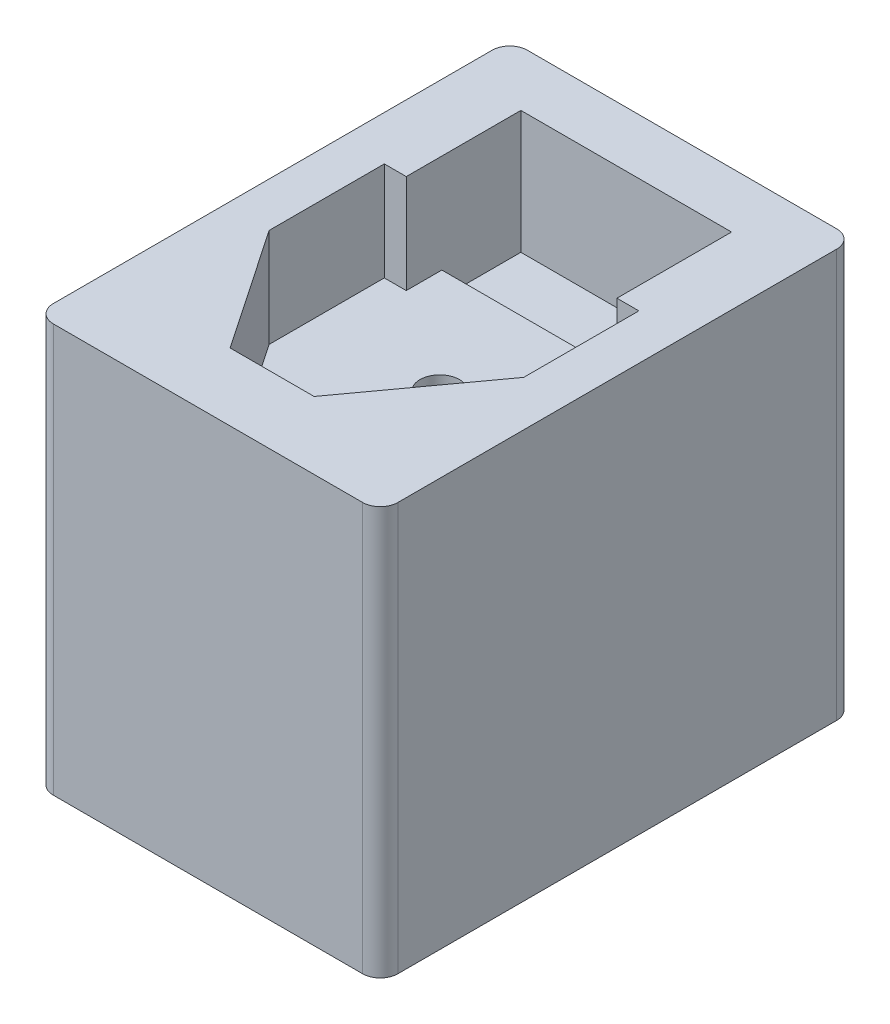
ISO-10303-21;
HEADER;
FILE_DESCRIPTION(('STEP AP214'),'2;1');
FILE_NAME('part.step','',(''),(''),'','','');
FILE_SCHEMA(('AUTOMOTIVE_DESIGN { 1 0 10303 214 1 1 1 1 }'));
ENDSEC;
DATA;
#1=APPLICATION_CONTEXT('core data for automotive mechanical design processes');
#2=APPLICATION_PROTOCOL_DEFINITION('international standard','automotive_design',2000,#1);
#3=PRODUCT_CONTEXT('',#1,'mechanical');
#4=PRODUCT('Part','Part','',(#3));
#5=PRODUCT_RELATED_PRODUCT_CATEGORY('part','',(#4));
#6=PRODUCT_DEFINITION_FORMATION('','',#4);
#7=PRODUCT_DEFINITION_CONTEXT('part definition',#1,'design');
#8=PRODUCT_DEFINITION('design','',#6,#7);
#9=PRODUCT_DEFINITION_SHAPE('','',#8);
#10=(LENGTH_UNIT() NAMED_UNIT(*) SI_UNIT(.MILLI.,.METRE.));
#11=(NAMED_UNIT(*) PLANE_ANGLE_UNIT() SI_UNIT($,.RADIAN.));
#12=(NAMED_UNIT(*) SI_UNIT($,.STERADIAN.) SOLID_ANGLE_UNIT());
#13=UNCERTAINTY_MEASURE_WITH_UNIT(LENGTH_MEASURE(1.E-05),#10,'distance_accuracy_value','');
#14=(GEOMETRIC_REPRESENTATION_CONTEXT(3) GLOBAL_UNCERTAINTY_ASSIGNED_CONTEXT((#13)) GLOBAL_UNIT_ASSIGNED_CONTEXT((#10,
#11,#12)) REPRESENTATION_CONTEXT('',''));
#15=CARTESIAN_POINT('',(0.,0.,0.));
#16=DIRECTION('',(0.,0.,1.));
#17=DIRECTION('',(1.,0.,0.));
#18=AXIS2_PLACEMENT_3D('',#15,#16,#17);
#19=CARTESIAN_POINT('',(-71.781203812325,31.8122496323421,5.04405962157267));
#20=DIRECTION('',(0.,1.,0.));
#21=DIRECTION('',(0.,0.,1.));
#22=AXIS2_PLACEMENT_3D('',#19,#20,#21);
#23=CYLINDRICAL_SURFACE('',#22,2.25);
#24=CARTESIAN_POINT('',(-71.781203812325,31.8122496323421,5.04405962157267));
#25=DIRECTION('',(0.,-1.,0.));
#26=DIRECTION('',(0.,0.,-1.));
#27=AXIS2_PLACEMENT_3D('',#24,#25,#26);
#28=CIRCLE('',#27,2.25);
#29=CARTESIAN_POINT('',(-71.781203812325,31.8122496323421,2.79405962157268));
#30=VERTEX_POINT('',#29);
#31=EDGE_CURVE('E266',#30,#30,#28,.T.);
#32=ORIENTED_EDGE('',*,*,#31,.T.);
#33=EDGE_LOOP('',(#32));
#34=FACE_BOUND('',#33,.T.);
#35=CARTESIAN_POINT('',(-71.781203812325,37.3122496323422,5.04405962157267));
#36=DIRECTION('',(0.,-1.,0.));
#37=DIRECTION('',(0.,0.,-1.));
#38=AXIS2_PLACEMENT_3D('',#35,#36,#37);
#39=CIRCLE('',#38,2.25);
#40=CARTESIAN_POINT('',(-71.781203812325,37.3122496323422,2.79405962157268));
#41=VERTEX_POINT('',#40);
#42=EDGE_CURVE('E11',#41,#41,#39,.T.);
#43=ORIENTED_EDGE('',*,*,#42,.F.);
#44=EDGE_LOOP('',(#43));
#45=FACE_BOUND('',#44,.T.);
#46=ADVANCED_FACE('F32',(#34,#45),#23,.F.);
#47=CARTESIAN_POINT('',(-71.781203812325,31.8122496323421,5.04405962157267));
#48=DIRECTION('',(0.,-1.,0.));
#49=DIRECTION('',(0.,0.,-1.));
#50=AXIS2_PLACEMENT_3D('',#47,#48,#49);
#51=PLANE('',#50);
#52=ORIENTED_EDGE('',*,*,#31,.F.);
#53=EDGE_LOOP('',(#52));
#54=FACE_BOUND('',#53,.T.);
#55=ADVANCED_FACE('F385',(#54),#51,.F.);
#56=CARTESIAN_POINT('',(-92.281203812325,37.3122496323422,23.0440596215727));
#57=DIRECTION('',(0.,1.,0.));
#58=DIRECTION('',(0.,0.,1.));
#59=AXIS2_PLACEMENT_3D('',#56,#57,#58);
#60=PLANE('',#59);
#61=ORIENTED_EDGE('',*,*,#42,.T.);
#62=EDGE_LOOP('',(#61));
#63=FACE_BOUND('',#62,.T.);
#64=DIRECTION('',(-0.561384277906192,0.,-0.827555250433313));
#65=VECTOR('',#64,1.);
#66=CARTESIAN_POINT('',(-86.0882732583618,37.3122496323422,10.1685580407173));
#67=LINE('',#66,#65);
#68=CARTESIAN_POINT('',(-76.7099842761094,37.3122496323422,23.9934059974333));
#69=VERTEX_POINT('',#68);
#70=CARTESIAN_POINT('',(-86.0882732583618,37.3122496323422,10.1685580407173));
#71=VERTEX_POINT('',#70);
#72=EDGE_CURVE('E56',#69,#71,#67,.T.);
#73=ORIENTED_EDGE('',*,*,#72,.F.);
#74=DIRECTION('',(-1.,0.,0.));
#75=VECTOR('',#74,1.);
#76=CARTESIAN_POINT('',(-76.7099842761094,37.3122496323422,23.9934059974333));
#77=LINE('',#76,#75);
#78=CARTESIAN_POINT('',(-67.1428706834759,37.3122496323422,23.9934059974333));
#79=VERTEX_POINT('',#78);
#80=EDGE_CURVE('E259',#79,#69,#77,.T.);
#81=ORIENTED_EDGE('',*,*,#80,.F.);
#82=DIRECTION('',(-0.58817791690703,0.,0.808731561188821));
#83=VECTOR('',#82,1.);
#84=CARTESIAN_POINT('',(-67.1428706834759,37.3122496323422,23.9934059974333));
#85=LINE('',#84,#83);
#86=CARTESIAN_POINT('',(-57.0882732583618,37.3122496323422,10.1685580407173));
#87=VERTEX_POINT('',#86);
#88=EDGE_CURVE('E257',#87,#79,#85,.T.);
#89=ORIENTED_EDGE('',*,*,#88,.F.);
#90=DIRECTION('',(0.,0.,1.));
#91=VECTOR('',#90,1.);
#92=CARTESIAN_POINT('',(-57.0882732583618,37.3122496323422,10.1685580407173));
#93=LINE('',#92,#91);
#94=CARTESIAN_POINT('',(-57.0882732583618,37.3122496323422,-2.95133298344728));
#95=VERTEX_POINT('',#94);
#96=EDGE_CURVE('E255',#95,#87,#93,.T.);
#97=ORIENTED_EDGE('',*,*,#96,.F.);
#98=DIRECTION('',(1.,0.,0.));
#99=VECTOR('',#98,1.);
#100=CARTESIAN_POINT('',(-57.0882732583618,37.3122496323422,-2.95133298344728));
#101=LINE('',#100,#99);
#102=CARTESIAN_POINT('',(-59.5882732583618,37.3122496323422,-2.95133298344728));
#103=VERTEX_POINT('',#102);
#104=EDGE_CURVE('E253',#103,#95,#101,.T.);
#105=ORIENTED_EDGE('',*,*,#104,.F.);
#106=DIRECTION('',(0.,0.,1.));
#107=VECTOR('',#106,1.);
#108=CARTESIAN_POINT('',(-59.5882732583618,37.3122496323422,-2.95133298344728));
#109=LINE('',#108,#107);
#110=CARTESIAN_POINT('',(-59.5882732583618,37.3122496323422,-7.00659400256669));
#111=VERTEX_POINT('',#110);
#112=EDGE_CURVE('E251',#111,#103,#109,.T.);
#113=ORIENTED_EDGE('',*,*,#112,.F.);
#114=DIRECTION('',(1.,0.,0.));
#115=VECTOR('',#114,1.);
#116=CARTESIAN_POINT('',(-83.5882732583618,37.3122496323422,-7.00659400256669));
#117=LINE('',#116,#115);
#118=CARTESIAN_POINT('',(-83.5882732583618,37.3122496323422,-7.00659400256669));
#119=VERTEX_POINT('',#118);
#120=EDGE_CURVE('E249',#119,#111,#117,.T.);
#121=ORIENTED_EDGE('',*,*,#120,.F.);
#122=DIRECTION('',(0.,0.,-1.));
#123=VECTOR('',#122,1.);
#124=CARTESIAN_POINT('',(-83.5882732583618,37.3122496323422,-7.00659400256669));
#125=LINE('',#124,#123);
#126=CARTESIAN_POINT('',(-83.5882732583618,37.3122496323422,-2.95133298344728));
#127=VERTEX_POINT('',#126);
#128=EDGE_CURVE('E246',#127,#119,#125,.T.);
#129=ORIENTED_EDGE('',*,*,#128,.F.);
#130=DIRECTION('',(1.,0.,0.));
#131=VECTOR('',#130,1.);
#132=CARTESIAN_POINT('',(-83.5882732583618,37.3122496323422,-2.95133298344728));
#133=LINE('',#132,#131);
#134=CARTESIAN_POINT('',(-86.0882732583618,37.3122496323422,-2.95133298344728));
#135=VERTEX_POINT('',#134);
#136=EDGE_CURVE('E244',#135,#127,#133,.T.);
#137=ORIENTED_EDGE('',*,*,#136,.F.);
#138=DIRECTION('',(0.,0.,-1.));
#139=VECTOR('',#138,1.);
#140=CARTESIAN_POINT('',(-86.0882732583618,37.3122496323422,-2.95133298344728));
#141=LINE('',#140,#139);
#142=EDGE_CURVE('E242',#71,#135,#141,.T.);
#143=ORIENTED_EDGE('',*,*,#142,.F.);
#144=EDGE_LOOP('',(#73,#81,#89,#97,#105,#113,#121,#129,#137,#143));
#145=FACE_BOUND('',#144,.T.);
#146=ADVANCED_FACE('F340',(#63,#145),#60,.T.);
#147=CARTESIAN_POINT('',(-83.5882732583618,37.3122496323422,-7.00659400256669));
#148=DIRECTION('',(0.,0.,-1.));
#149=DIRECTION('',(-1.,0.,0.));
#150=AXIS2_PLACEMENT_3D('',#147,#148,#149);
#151=PLANE('',#150);
#152=DIRECTION('',(1.,0.,0.));
#153=VECTOR('',#152,1.);
#154=CARTESIAN_POINT('',(-83.5882732583618,34.5622496323421,-7.00659400256669));
#155=LINE('',#154,#153);
#156=CARTESIAN_POINT('',(-83.5882732583618,34.5622496323421,-7.00659400256669));
#157=VERTEX_POINT('',#156);
#158=CARTESIAN_POINT('',(-59.5882732583618,34.5622496323421,-7.00659400256669));
#159=VERTEX_POINT('',#158);
#160=EDGE_CURVE('E41',#157,#159,#155,.T.);
#161=ORIENTED_EDGE('',*,*,#160,.F.);
#162=DIRECTION('',(0.,-1.,0.));
#163=VECTOR('',#162,1.);
#164=CARTESIAN_POINT('',(-83.5882732583618,37.3122496323422,-7.00659400256669));
#165=LINE('',#164,#163);
#166=EDGE_CURVE('E261',#119,#157,#165,.T.);
#167=ORIENTED_EDGE('',*,*,#166,.F.);
#168=ORIENTED_EDGE('',*,*,#120,.T.);
#169=DIRECTION('',(0.,-1.,0.));
#170=VECTOR('',#169,1.);
#171=CARTESIAN_POINT('',(-59.5882732583618,37.3122496323422,-7.00659400256669));
#172=LINE('',#171,#170);
#173=EDGE_CURVE('E263',#111,#159,#172,.T.);
#174=ORIENTED_EDGE('',*,*,#173,.T.);
#175=EDGE_LOOP('',(#161,#167,#168,#174));
#176=FACE_BOUND('',#175,.T.);
#177=ADVANCED_FACE('F335',(#176),#151,.T.);
#178=CARTESIAN_POINT('',(-92.281203812325,34.5622496323421,23.0440596215727));
#179=DIRECTION('',(0.,-1.,0.));
#180=DIRECTION('',(0.,0.,-1.));
#181=AXIS2_PLACEMENT_3D('',#178,#179,#180);
#182=PLANE('',#181);
#183=ORIENTED_EDGE('',*,*,#160,.T.);
#184=DIRECTION('',(0.,0.,1.));
#185=VECTOR('',#184,1.);
#186=CARTESIAN_POINT('',(-59.5882732583618,34.5622496323421,-16.0065940025667));
#187=LINE('',#186,#185);
#188=CARTESIAN_POINT('',(-59.5882732583618,34.5622496323421,-16.0065940025667));
#189=VERTEX_POINT('',#188);
#190=EDGE_CURVE('E297',#189,#159,#187,.T.);
#191=ORIENTED_EDGE('',*,*,#190,.F.);
#192=DIRECTION('',(1.,0.,0.));
#193=VECTOR('',#192,1.);
#194=CARTESIAN_POINT('',(-83.5882732583618,34.5622496323421,-16.0065940025667));
#195=LINE('',#194,#193);
#196=CARTESIAN_POINT('',(-83.5882732583618,34.5622496323421,-16.0065940025667));
#197=VERTEX_POINT('',#196);
#198=EDGE_CURVE('E295',#197,#189,#195,.T.);
#199=ORIENTED_EDGE('',*,*,#198,.F.);
#200=DIRECTION('',(0.,0.,-1.));
#201=VECTOR('',#200,1.);
#202=CARTESIAN_POINT('',(-83.5882732583618,34.5622496323421,-2.95133298344728));
#203=LINE('',#202,#201);
#204=EDGE_CURVE('E271',#157,#197,#203,.T.);
#205=ORIENTED_EDGE('',*,*,#204,.F.);
#206=EDGE_LOOP('',(#183,#191,#199,#205));
#207=FACE_BOUND('',#206,.T.);
#208=ADVANCED_FACE('F331',(#207),#182,.F.);
#209=CARTESIAN_POINT('',(-83.5882732583618,48.5622496323421,-16.0065940025667));
#210=DIRECTION('',(0.,0.,-1.));
#211=DIRECTION('',(-1.,0.,0.));
#212=AXIS2_PLACEMENT_3D('',#209,#210,#211);
#213=PLANE('',#212);
#214=ORIENTED_EDGE('',*,*,#198,.T.);
#215=DIRECTION('',(0.,-1.,0.));
#216=VECTOR('',#215,1.);
#217=CARTESIAN_POINT('',(-59.5882732583618,48.5622496323421,-16.0065940025667));
#218=LINE('',#217,#216);
#219=CARTESIAN_POINT('',(-59.5882732583618,48.5622496323421,-16.0065940025667));
#220=VERTEX_POINT('',#219);
#221=EDGE_CURVE('E319',#220,#189,#218,.T.);
#222=ORIENTED_EDGE('',*,*,#221,.F.);
#223=DIRECTION('',(1.,0.,0.));
#224=VECTOR('',#223,1.);
#225=CARTESIAN_POINT('',(-83.5882732583618,48.5622496323421,-16.0065940025667));
#226=LINE('',#225,#224);
#227=CARTESIAN_POINT('',(-83.5882732583618,48.5622496323421,-16.0065940025667));
#228=VERTEX_POINT('',#227);
#229=EDGE_CURVE('E239',#228,#220,#226,.T.);
#230=ORIENTED_EDGE('',*,*,#229,.F.);
#231=DIRECTION('',(0.,-1.,0.));
#232=VECTOR('',#231,1.);
#233=CARTESIAN_POINT('',(-83.5882732583618,48.5622496323421,-16.0065940025667));
#234=LINE('',#233,#232);
#235=EDGE_CURVE('E36',#228,#197,#234,.T.);
#236=ORIENTED_EDGE('',*,*,#235,.T.);
#237=EDGE_LOOP('',(#214,#222,#230,#236));
#238=FACE_BOUND('',#237,.T.);
#239=ADVANCED_FACE('F327',(#238),#213,.F.);
#240=CARTESIAN_POINT('',(-59.5882732583618,48.5622496323421,-16.0065940025667));
#241=DIRECTION('',(1.,0.,0.));
#242=DIRECTION('',(0.,0.,-1.));
#243=AXIS2_PLACEMENT_3D('',#240,#241,#242);
#244=PLANE('',#243);
#245=ORIENTED_EDGE('',*,*,#173,.F.);
#246=ORIENTED_EDGE('',*,*,#112,.T.);
#247=DIRECTION('',(0.,-1.,0.));
#248=VECTOR('',#247,1.);
#249=CARTESIAN_POINT('',(-59.5882732583618,48.5622496323421,-2.95133298344728));
#250=LINE('',#249,#248);
#251=CARTESIAN_POINT('',(-59.5882732583618,48.5622496323421,-2.95133298344728));
#252=VERTEX_POINT('',#251);
#253=EDGE_CURVE('E317',#252,#103,#250,.T.);
#254=ORIENTED_EDGE('',*,*,#253,.F.);
#255=DIRECTION('',(0.,0.,1.));
#256=VECTOR('',#255,1.);
#257=CARTESIAN_POINT('',(-59.5882732583618,48.5622496323421,-16.0065940025667));
#258=LINE('',#257,#256);
#259=EDGE_CURVE('E278',#220,#252,#258,.T.);
#260=ORIENTED_EDGE('',*,*,#259,.F.);
#261=ORIENTED_EDGE('',*,*,#221,.T.);
#262=ORIENTED_EDGE('',*,*,#190,.T.);
#263=EDGE_LOOP('',(#245,#246,#254,#260,#261,#262));
#264=FACE_BOUND('',#263,.T.);
#265=ADVANCED_FACE('F333',(#264),#244,.F.);
#266=CARTESIAN_POINT('',(-59.5882732583618,48.5622496323421,-2.95133298344728));
#267=DIRECTION('',(0.,0.,-1.));
#268=DIRECTION('',(-1.,0.,0.));
#269=AXIS2_PLACEMENT_3D('',#266,#267,#268);
#270=PLANE('',#269);
#271=ORIENTED_EDGE('',*,*,#104,.T.);
#272=DIRECTION('',(0.,-1.,0.));
#273=VECTOR('',#272,1.);
#274=CARTESIAN_POINT('',(-57.0882732583618,48.5622496323421,-2.95133298344728));
#275=LINE('',#274,#273);
#276=CARTESIAN_POINT('',(-57.0882732583618,48.5622496323421,-2.95133298344728));
#277=VERTEX_POINT('',#276);
#278=EDGE_CURVE('E314',#277,#95,#275,.T.);
#279=ORIENTED_EDGE('',*,*,#278,.F.);
#280=DIRECTION('',(1.,0.,0.));
#281=VECTOR('',#280,1.);
#282=CARTESIAN_POINT('',(-59.5882732583618,48.5622496323421,-2.95133298344728));
#283=LINE('',#282,#281);
#284=EDGE_CURVE('E280',#252,#277,#283,.T.);
#285=ORIENTED_EDGE('',*,*,#284,.F.);
#286=ORIENTED_EDGE('',*,*,#253,.T.);
#287=EDGE_LOOP('',(#271,#279,#285,#286));
#288=FACE_BOUND('',#287,.T.);
#289=ADVANCED_FACE('F345',(#288),#270,.F.);
#290=CARTESIAN_POINT('',(-57.0882732583618,48.5622496323421,-2.95133298344728));
#291=DIRECTION('',(1.,0.,0.));
#292=DIRECTION('',(0.,0.,-1.));
#293=AXIS2_PLACEMENT_3D('',#290,#291,#292);
#294=PLANE('',#293);
#295=ORIENTED_EDGE('',*,*,#96,.T.);
#296=DIRECTION('',(0.,-1.,0.));
#297=VECTOR('',#296,1.);
#298=CARTESIAN_POINT('',(-57.0882732583618,48.5622496323421,10.1685580407173));
#299=LINE('',#298,#297);
#300=CARTESIAN_POINT('',(-57.0882732583618,48.5622496323421,10.1685580407173));
#301=VERTEX_POINT('',#300);
#302=EDGE_CURVE('E311',#301,#87,#299,.T.);
#303=ORIENTED_EDGE('',*,*,#302,.F.);
#304=DIRECTION('',(0.,0.,1.));
#305=VECTOR('',#304,1.);
#306=CARTESIAN_POINT('',(-57.0882732583618,48.5622496323421,-2.95133298344728));
#307=LINE('',#306,#305);
#308=EDGE_CURVE('E282',#277,#301,#307,.T.);
#309=ORIENTED_EDGE('',*,*,#308,.F.);
#310=ORIENTED_EDGE('',*,*,#278,.T.);
#311=EDGE_LOOP('',(#295,#303,#309,#310));
#312=FACE_BOUND('',#311,.T.);
#313=ADVANCED_FACE('F375',(#312),#294,.F.);
#314=CARTESIAN_POINT('',(-57.0882732583618,48.5622496323421,10.1685580407173));
#315=DIRECTION('',(0.808731561188821,0.,0.58817791690703));
#316=DIRECTION('',(0.58817791690703,0.,-0.808731561188821));
#317=AXIS2_PLACEMENT_3D('',#314,#315,#316);
#318=PLANE('',#317);
#319=ORIENTED_EDGE('',*,*,#88,.T.);
#320=DIRECTION('',(0.,-1.,0.));
#321=VECTOR('',#320,1.);
#322=CARTESIAN_POINT('',(-67.1428706834759,48.5622496323421,23.9934059974333));
#323=LINE('',#322,#321);
#324=CARTESIAN_POINT('',(-67.1428706834759,48.5622496323421,23.9934059974333));
#325=VERTEX_POINT('',#324);
#326=EDGE_CURVE('E308',#325,#79,#323,.T.);
#327=ORIENTED_EDGE('',*,*,#326,.F.);
#328=DIRECTION('',(-0.58817791690703,0.,0.808731561188821));
#329=VECTOR('',#328,1.);
#330=CARTESIAN_POINT('',(-57.0882732583618,48.5622496323421,10.1685580407173));
#331=LINE('',#330,#329);
#332=EDGE_CURVE('E284',#301,#325,#331,.T.);
#333=ORIENTED_EDGE('',*,*,#332,.F.);
#334=ORIENTED_EDGE('',*,*,#302,.T.);
#335=EDGE_LOOP('',(#319,#327,#333,#334));
#336=FACE_BOUND('',#335,.T.);
#337=ADVANCED_FACE('F373',(#336),#318,.F.);
#338=CARTESIAN_POINT('',(-67.1428706834759,48.5622496323421,23.9934059974333));
#339=DIRECTION('',(0.,0.,1.));
#340=DIRECTION('',(1.,0.,0.));
#341=AXIS2_PLACEMENT_3D('',#338,#339,#340);
#342=PLANE('',#341);
#343=ORIENTED_EDGE('',*,*,#80,.T.);
#344=DIRECTION('',(0.,-1.,0.));
#345=VECTOR('',#344,1.);
#346=CARTESIAN_POINT('',(-76.7099842761094,48.5622496323421,23.9934059974333));
#347=LINE('',#346,#345);
#348=CARTESIAN_POINT('',(-76.7099842761094,48.5622496323421,23.9934059974333));
#349=VERTEX_POINT('',#348);
#350=EDGE_CURVE('E306',#349,#69,#347,.T.);
#351=ORIENTED_EDGE('',*,*,#350,.F.);
#352=DIRECTION('',(-1.,0.,0.));
#353=VECTOR('',#352,1.);
#354=CARTESIAN_POINT('',(-67.1428706834759,48.5622496323421,23.9934059974333));
#355=LINE('',#354,#353);
#356=EDGE_CURVE('E286',#325,#349,#355,.T.);
#357=ORIENTED_EDGE('',*,*,#356,.F.);
#358=ORIENTED_EDGE('',*,*,#326,.T.);
#359=EDGE_LOOP('',(#343,#351,#357,#358));
#360=FACE_BOUND('',#359,.T.);
#361=ADVANCED_FACE('F370',(#360),#342,.F.);
#362=CARTESIAN_POINT('',(-76.7099842761094,48.5622496323421,23.9934059974333));
#363=DIRECTION('',(-0.827555250433313,0.,0.561384277906192));
#364=DIRECTION('',(0.561384277906192,0.,0.827555250433313));
#365=AXIS2_PLACEMENT_3D('',#362,#363,#364);
#366=PLANE('',#365);
#367=ORIENTED_EDGE('',*,*,#72,.T.);
#368=DIRECTION('',(0.,-1.,0.));
#369=VECTOR('',#368,1.);
#370=CARTESIAN_POINT('',(-86.0882732583618,48.5622496323421,10.1685580407173));
#371=LINE('',#370,#369);
#372=CARTESIAN_POINT('',(-86.0882732583618,48.5622496323421,10.1685580407173));
#373=VERTEX_POINT('',#372);
#374=EDGE_CURVE('E304',#373,#71,#371,.T.);
#375=ORIENTED_EDGE('',*,*,#374,.F.);
#376=DIRECTION('',(-0.561384277906192,0.,-0.827555250433313));
#377=VECTOR('',#376,1.);
#378=CARTESIAN_POINT('',(-76.7099842761094,48.5622496323421,23.9934059974333));
#379=LINE('',#378,#377);
#380=EDGE_CURVE('E288',#349,#373,#379,.T.);
#381=ORIENTED_EDGE('',*,*,#380,.F.);
#382=ORIENTED_EDGE('',*,*,#350,.T.);
#383=EDGE_LOOP('',(#367,#375,#381,#382));
#384=FACE_BOUND('',#383,.T.);
#385=ADVANCED_FACE('F364',(#384),#366,.F.);
#386=CARTESIAN_POINT('',(-86.0882732583618,48.5622496323421,10.1685580407173));
#387=DIRECTION('',(-1.,0.,0.));
#388=DIRECTION('',(0.,0.,1.));
#389=AXIS2_PLACEMENT_3D('',#386,#387,#388);
#390=PLANE('',#389);
#391=ORIENTED_EDGE('',*,*,#142,.T.);
#392=DIRECTION('',(0.,-1.,0.));
#393=VECTOR('',#392,1.);
#394=CARTESIAN_POINT('',(-86.0882732583618,48.5622496323421,-2.95133298344728));
#395=LINE('',#394,#393);
#396=CARTESIAN_POINT('',(-86.0882732583618,48.5622496323421,-2.95133298344728));
#397=VERTEX_POINT('',#396);
#398=EDGE_CURVE('E301',#397,#135,#395,.T.);
#399=ORIENTED_EDGE('',*,*,#398,.F.);
#400=DIRECTION('',(0.,0.,-1.));
#401=VECTOR('',#400,1.);
#402=CARTESIAN_POINT('',(-86.0882732583618,48.5622496323421,10.1685580407173));
#403=LINE('',#402,#401);
#404=EDGE_CURVE('E290',#373,#397,#403,.T.);
#405=ORIENTED_EDGE('',*,*,#404,.F.);
#406=ORIENTED_EDGE('',*,*,#374,.T.);
#407=EDGE_LOOP('',(#391,#399,#405,#406));
#408=FACE_BOUND('',#407,.T.);
#409=ADVANCED_FACE('F361',(#408),#390,.F.);
#410=CARTESIAN_POINT('',(-86.0882732583618,48.5622496323421,-2.95133298344728));
#411=DIRECTION('',(0.,0.,-1.));
#412=DIRECTION('',(-1.,0.,0.));
#413=AXIS2_PLACEMENT_3D('',#410,#411,#412);
#414=PLANE('',#413);
#415=ORIENTED_EDGE('',*,*,#136,.T.);
#416=DIRECTION('',(0.,-1.,0.));
#417=VECTOR('',#416,1.);
#418=CARTESIAN_POINT('',(-83.5882732583618,48.5622496323421,-2.95133298344728));
#419=LINE('',#418,#417);
#420=CARTESIAN_POINT('',(-83.5882732583618,48.5622496323421,-2.95133298344728));
#421=VERTEX_POINT('',#420);
#422=EDGE_CURVE('E275',#421,#127,#419,.T.);
#423=ORIENTED_EDGE('',*,*,#422,.F.);
#424=DIRECTION('',(1.,0.,0.));
#425=VECTOR('',#424,1.);
#426=CARTESIAN_POINT('',(-86.0882732583618,48.5622496323421,-2.95133298344728));
#427=LINE('',#426,#425);
#428=EDGE_CURVE('E276',#397,#421,#427,.T.);
#429=ORIENTED_EDGE('',*,*,#428,.F.);
#430=ORIENTED_EDGE('',*,*,#398,.T.);
#431=EDGE_LOOP('',(#415,#423,#429,#430));
#432=FACE_BOUND('',#431,.T.);
#433=ADVANCED_FACE('F355',(#432),#414,.F.);
#434=CARTESIAN_POINT('',(-83.5882732583618,48.5622496323421,-2.95133298344728));
#435=DIRECTION('',(-1.,0.,0.));
#436=DIRECTION('',(0.,0.,1.));
#437=AXIS2_PLACEMENT_3D('',#434,#435,#436);
#438=PLANE('',#437);
#439=ORIENTED_EDGE('',*,*,#166,.T.);
#440=ORIENTED_EDGE('',*,*,#204,.T.);
#441=ORIENTED_EDGE('',*,*,#235,.F.);
#442=DIRECTION('',(0.,0.,-1.));
#443=VECTOR('',#442,1.);
#444=CARTESIAN_POINT('',(-83.5882732583618,48.5622496323421,-2.95133298344728));
#445=LINE('',#444,#443);
#446=EDGE_CURVE('E272',#421,#228,#445,.T.);
#447=ORIENTED_EDGE('',*,*,#446,.F.);
#448=ORIENTED_EDGE('',*,*,#422,.T.);
#449=ORIENTED_EDGE('',*,*,#128,.T.);
#450=EDGE_LOOP('',(#439,#440,#441,#447,#448,#449));
#451=FACE_BOUND('',#450,.T.);
#452=ADVANCED_FACE('F34',(#451),#438,.F.);
#453=CARTESIAN_POINT('',(-51.9142945748868,2.06224963234215,31.6854601466434));
#454=DIRECTION('',(0.,-1.,0.));
#455=DIRECTION('',(-1.,0.,0.));
#456=AXIS2_PLACEMENT_3D('',#453,#454,#455);
#457=PLANE('',#456);
#458=DIRECTION('',(0.,0.,1.));
#459=VECTOR('',#458,1.);
#460=CARTESIAN_POINT('',(-91.1642945748868,2.06224963234215,31.6854601466435));
#461=LINE('',#460,#459);
#462=CARTESIAN_POINT('',(-91.164294574887,2.06224963234215,-20.3145398533565));
#463=VERTEX_POINT('',#462);
#464=CARTESIAN_POINT('',(-91.1642945748868,2.06224963234215,29.6854601466435));
#465=VERTEX_POINT('',#464);
#466=EDGE_CURVE('E203',#463,#465,#461,.T.);
#467=ORIENTED_EDGE('',*,*,#466,.F.);
#468=CARTESIAN_POINT('',(-89.164294574887,2.06224963234215,-20.3145398533565));
#469=DIRECTION('',(0.,-1.,0.));
#470=DIRECTION('',(-1.,0.,0.));
#471=AXIS2_PLACEMENT_3D('',#468,#469,#470);
#472=CIRCLE('',#471,2.);
#473=CARTESIAN_POINT('',(-89.164294574887,2.06224963234215,-22.3145398533565));
#474=VERTEX_POINT('',#473);
#475=EDGE_CURVE('E222',#463,#474,#472,.T.);
#476=ORIENTED_EDGE('',*,*,#475,.T.);
#477=DIRECTION('',(-1.,0.,0.));
#478=VECTOR('',#477,1.);
#479=CARTESIAN_POINT('',(-51.914294574887,2.06224963234215,-22.3145398533566));
#480=LINE('',#479,#478);
#481=CARTESIAN_POINT('',(-53.914294574887,2.06224963234215,-22.3145398533566));
#482=VERTEX_POINT('',#481);
#483=EDGE_CURVE('E199',#482,#474,#480,.T.);
#484=ORIENTED_EDGE('',*,*,#483,.F.);
#485=CARTESIAN_POINT('',(-53.914294574887,2.06224963234215,-20.3145398533566));
#486=DIRECTION('',(0.,-1.,0.));
#487=DIRECTION('',(-1.,0.,0.));
#488=AXIS2_PLACEMENT_3D('',#485,#486,#487);
#489=CIRCLE('',#488,2.);
#490=CARTESIAN_POINT('',(-51.914294574887,2.06224963234215,-20.3145398533566));
#491=VERTEX_POINT('',#490);
#492=EDGE_CURVE('E198',#482,#491,#489,.T.);
#493=ORIENTED_EDGE('',*,*,#492,.T.);
#494=DIRECTION('',(0.,0.,-1.));
#495=VECTOR('',#494,1.);
#496=CARTESIAN_POINT('',(-51.9142945748868,2.06224963234215,31.6854601466434));
#497=LINE('',#496,#495);
#498=CARTESIAN_POINT('',(-51.9142945748868,2.06224963234215,29.6854601466434));
#499=VERTEX_POINT('',#498);
#500=EDGE_CURVE('E189',#499,#491,#497,.T.);
#501=ORIENTED_EDGE('',*,*,#500,.F.);
#502=CARTESIAN_POINT('',(-53.9142945748868,2.06224963234215,29.6854601466434));
#503=DIRECTION('',(0.,-1.,0.));
#504=DIRECTION('',(-1.,0.,0.));
#505=AXIS2_PLACEMENT_3D('',#502,#503,#504);
#506=CIRCLE('',#505,2.);
#507=CARTESIAN_POINT('',(-53.9142945748868,2.06224963234215,31.6854601466434));
#508=VERTEX_POINT('',#507);
#509=EDGE_CURVE('E174',#499,#508,#506,.T.);
#510=ORIENTED_EDGE('',*,*,#509,.T.);
#511=DIRECTION('',(1.,0.,0.));
#512=VECTOR('',#511,1.);
#513=CARTESIAN_POINT('',(-51.9142945748868,2.06224963234215,31.6854601466434));
#514=LINE('',#513,#512);
#515=CARTESIAN_POINT('',(-89.1642945748868,2.06224963234215,31.6854601466435));
#516=VERTEX_POINT('',#515);
#517=EDGE_CURVE('E200',#516,#508,#514,.T.);
#518=ORIENTED_EDGE('',*,*,#517,.F.);
#519=CARTESIAN_POINT('',(-89.1642945748868,2.06224963234215,29.6854601466435));
#520=DIRECTION('',(0.,-1.,0.));
#521=DIRECTION('',(-1.,0.,0.));
#522=AXIS2_PLACEMENT_3D('',#519,#520,#521);
#523=CIRCLE('',#522,2.);
#524=EDGE_CURVE('E219',#516,#465,#523,.T.);
#525=ORIENTED_EDGE('',*,*,#524,.T.);
#526=EDGE_LOOP('',(#467,#476,#484,#493,#501,#510,#518,#525));
#527=FACE_BOUND('',#526,.T.);
#528=ADVANCED_FACE('F196',(#527),#457,.T.);
#529=CARTESIAN_POINT('',(-53.914294574887,48.5622496323421,-20.3145398533566));
#530=DIRECTION('',(0.,-1.,0.));
#531=DIRECTION('',(-1.,0.,0.));
#532=AXIS2_PLACEMENT_3D('',#529,#530,#531);
#533=CYLINDRICAL_SURFACE('',#532,2.);
#534=CARTESIAN_POINT('',(-53.914294574887,48.5622496323421,-20.3145398533566));
#535=DIRECTION('',(0.,-1.,0.));
#536=DIRECTION('',(-1.,0.,0.));
#537=AXIS2_PLACEMENT_3D('',#534,#535,#536);
#538=CIRCLE('',#537,2.);
#539=CARTESIAN_POINT('',(-51.914294574887,48.5622496323421,-20.3145398533566));
#540=VERTEX_POINT('',#539);
#541=CARTESIAN_POINT('',(-53.914294574887,48.5622496323421,-22.3145398533566));
#542=VERTEX_POINT('',#541);
#543=EDGE_CURVE('E231',#540,#542,#538,.F.);
#544=ORIENTED_EDGE('',*,*,#543,.F.);
#545=DIRECTION('',(0.,-1.,0.));
#546=VECTOR('',#545,1.);
#547=CARTESIAN_POINT('',(-51.914294574887,48.5622496323421,-20.3145398533566));
#548=LINE('',#547,#546);
#549=EDGE_CURVE('E235',#491,#540,#548,.F.);
#550=ORIENTED_EDGE('',*,*,#549,.F.);
#551=ORIENTED_EDGE('',*,*,#492,.F.);
#552=DIRECTION('',(0.,-1.,0.));
#553=VECTOR('',#552,1.);
#554=CARTESIAN_POINT('',(-53.914294574887,48.5622496323421,-22.3145398533566));
#555=LINE('',#554,#553);
#556=EDGE_CURVE('E224',#542,#482,#555,.T.);
#557=ORIENTED_EDGE('',*,*,#556,.F.);
#558=EDGE_LOOP('',(#544,#550,#551,#557));
#559=FACE_BOUND('',#558,.T.);
#560=ADVANCED_FACE('F433',(#559),#533,.T.);
#561=CARTESIAN_POINT('',(-51.9142945748868,48.5622496323421,31.6854601466434));
#562=DIRECTION('',(-1.,0.,0.));
#563=DIRECTION('',(0.,0.,1.));
#564=AXIS2_PLACEMENT_3D('',#561,#562,#563);
#565=PLANE('',#564);
#566=ORIENTED_EDGE('',*,*,#500,.T.);
#567=ORIENTED_EDGE('',*,*,#549,.T.);
#568=DIRECTION('',(0.,0.,-1.));
#569=VECTOR('',#568,1.);
#570=CARTESIAN_POINT('',(-51.9142945748868,48.5622496323421,31.6854601466434));
#571=LINE('',#570,#569);
#572=CARTESIAN_POINT('',(-51.9142945748868,48.5622496323421,29.6854601466434));
#573=VERTEX_POINT('',#572);
#574=EDGE_CURVE('E192',#573,#540,#571,.T.);
#575=ORIENTED_EDGE('',*,*,#574,.F.);
#576=DIRECTION('',(0.,-1.,0.));
#577=VECTOR('',#576,1.);
#578=CARTESIAN_POINT('',(-51.9142945748868,48.5622496323421,29.6854601466434));
#579=LINE('',#578,#577);
#580=EDGE_CURVE('E178',#573,#499,#579,.T.);
#581=ORIENTED_EDGE('',*,*,#580,.T.);
#582=EDGE_LOOP('',(#566,#567,#575,#581));
#583=FACE_BOUND('',#582,.T.);
#584=ADVANCED_FACE('F188',(#583),#565,.F.);
#585=CARTESIAN_POINT('',(-53.9142945748868,48.5622496323421,29.6854601466434));
#586=DIRECTION('',(0.,-1.,0.));
#587=DIRECTION('',(-1.,0.,0.));
#588=AXIS2_PLACEMENT_3D('',#585,#586,#587);
#589=CYLINDRICAL_SURFACE('',#588,2.);
#590=CARTESIAN_POINT('',(-53.9142945748868,48.5622496323421,29.6854601466434));
#591=DIRECTION('',(0.,-1.,0.));
#592=DIRECTION('',(-1.,0.,0.));
#593=AXIS2_PLACEMENT_3D('',#590,#591,#592);
#594=CIRCLE('',#593,2.);
#595=CARTESIAN_POINT('',(-53.9142945748868,48.5622496323421,31.6854601466434));
#596=VERTEX_POINT('',#595);
#597=EDGE_CURVE('E212',#596,#573,#594,.F.);
#598=ORIENTED_EDGE('',*,*,#597,.F.);
#599=DIRECTION('',(0.,-1.,0.));
#600=VECTOR('',#599,1.);
#601=CARTESIAN_POINT('',(-53.9142945748868,48.5622496323421,31.6854601466434));
#602=LINE('',#601,#600);
#603=EDGE_CURVE('E180',#508,#596,#602,.F.);
#604=ORIENTED_EDGE('',*,*,#603,.F.);
#605=ORIENTED_EDGE('',*,*,#509,.F.);
#606=ORIENTED_EDGE('',*,*,#580,.F.);
#607=EDGE_LOOP('',(#598,#604,#605,#606));
#608=FACE_BOUND('',#607,.T.);
#609=ADVANCED_FACE('F177',(#608),#589,.T.);
#610=CARTESIAN_POINT('',(-51.9142945748868,48.5622496323421,31.6854601466434));
#611=DIRECTION('',(0.,0.,-1.));
#612=DIRECTION('',(-1.,0.,0.));
#613=AXIS2_PLACEMENT_3D('',#610,#611,#612);
#614=PLANE('',#613);
#615=DIRECTION('',(1.,0.,0.));
#616=VECTOR('',#615,1.);
#617=CARTESIAN_POINT('',(-51.9142945748868,48.5622496323421,31.6854601466434));
#618=LINE('',#617,#616);
#619=CARTESIAN_POINT('',(-89.1642945748868,48.5622496323421,31.6854601466435));
#620=VERTEX_POINT('',#619);
#621=EDGE_CURVE('E209',#620,#596,#618,.T.);
#622=ORIENTED_EDGE('',*,*,#621,.F.);
#623=DIRECTION('',(0.,-1.,0.));
#624=VECTOR('',#623,1.);
#625=CARTESIAN_POINT('',(-89.1642945748868,48.5622496323421,31.6854601466435));
#626=LINE('',#625,#624);
#627=EDGE_CURVE('E237',#620,#516,#626,.T.);
#628=ORIENTED_EDGE('',*,*,#627,.T.);
#629=ORIENTED_EDGE('',*,*,#517,.T.);
#630=ORIENTED_EDGE('',*,*,#603,.T.);
#631=EDGE_LOOP('',(#622,#628,#629,#630));
#632=FACE_BOUND('',#631,.T.);
#633=ADVANCED_FACE('F458',(#632),#614,.F.);
#634=CARTESIAN_POINT('',(-89.1642945748868,48.5622496323421,29.6854601466435));
#635=DIRECTION('',(0.,-1.,0.));
#636=DIRECTION('',(-1.,0.,0.));
#637=AXIS2_PLACEMENT_3D('',#634,#635,#636);
#638=CYLINDRICAL_SURFACE('',#637,2.);
#639=CARTESIAN_POINT('',(-89.1642945748868,48.5622496323421,29.6854601466435));
#640=DIRECTION('',(0.,-1.,0.));
#641=DIRECTION('',(-1.,0.,0.));
#642=AXIS2_PLACEMENT_3D('',#639,#640,#641);
#643=CIRCLE('',#642,2.);
#644=CARTESIAN_POINT('',(-91.1642945748868,48.5622496323421,29.6854601466435));
#645=VERTEX_POINT('',#644);
#646=EDGE_CURVE('E229',#645,#620,#643,.F.);
#647=ORIENTED_EDGE('',*,*,#646,.F.);
#648=DIRECTION('',(0.,-1.,0.));
#649=VECTOR('',#648,1.);
#650=CARTESIAN_POINT('',(-91.1642945748868,48.5622496323421,29.6854601466435));
#651=LINE('',#650,#649);
#652=EDGE_CURVE('E214',#465,#645,#651,.F.);
#653=ORIENTED_EDGE('',*,*,#652,.F.);
#654=ORIENTED_EDGE('',*,*,#524,.F.);
#655=ORIENTED_EDGE('',*,*,#627,.F.);
#656=EDGE_LOOP('',(#647,#653,#654,#655));
#657=FACE_BOUND('',#656,.T.);
#658=ADVANCED_FACE('F464',(#657),#638,.T.);
#659=CARTESIAN_POINT('',(-91.1642945748868,48.5622496323421,31.6854601466435));
#660=DIRECTION('',(1.,0.,0.));
#661=DIRECTION('',(0.,0.,-1.));
#662=AXIS2_PLACEMENT_3D('',#659,#660,#661);
#663=PLANE('',#662);
#664=DIRECTION('',(0.,0.,1.));
#665=VECTOR('',#664,1.);
#666=CARTESIAN_POINT('',(-91.1642945748868,48.5622496323421,31.6854601466435));
#667=LINE('',#666,#665);
#668=CARTESIAN_POINT('',(-91.164294574887,48.5622496323421,-20.3145398533565));
#669=VERTEX_POINT('',#668);
#670=EDGE_CURVE('E193',#669,#645,#667,.T.);
#671=ORIENTED_EDGE('',*,*,#670,.F.);
#672=DIRECTION('',(0.,-1.,0.));
#673=VECTOR('',#672,1.);
#674=CARTESIAN_POINT('',(-91.164294574887,48.5622496323421,-20.3145398533565));
#675=LINE('',#674,#673);
#676=EDGE_CURVE('E216',#669,#463,#675,.T.);
#677=ORIENTED_EDGE('',*,*,#676,.T.);
#678=ORIENTED_EDGE('',*,*,#466,.T.);
#679=ORIENTED_EDGE('',*,*,#652,.T.);
#680=EDGE_LOOP('',(#671,#677,#678,#679));
#681=FACE_BOUND('',#680,.T.);
#682=ADVANCED_FACE('F471',(#681),#663,.F.);
#683=CARTESIAN_POINT('',(-89.164294574887,48.5622496323421,-20.3145398533565));
#684=DIRECTION('',(0.,-1.,0.));
#685=DIRECTION('',(-1.,0.,0.));
#686=AXIS2_PLACEMENT_3D('',#683,#684,#685);
#687=CYLINDRICAL_SURFACE('',#686,2.);
#688=CARTESIAN_POINT('',(-89.164294574887,48.5622496323421,-20.3145398533565));
#689=DIRECTION('',(0.,-1.,0.));
#690=DIRECTION('',(-1.,0.,0.));
#691=AXIS2_PLACEMENT_3D('',#688,#689,#690);
#692=CIRCLE('',#691,2.);
#693=CARTESIAN_POINT('',(-89.164294574887,48.5622496323421,-22.3145398533565));
#694=VERTEX_POINT('',#693);
#695=EDGE_CURVE('E233',#694,#669,#692,.F.);
#696=ORIENTED_EDGE('',*,*,#695,.F.);
#697=DIRECTION('',(0.,-1.,0.));
#698=VECTOR('',#697,1.);
#699=CARTESIAN_POINT('',(-89.164294574887,48.5622496323421,-22.3145398533565));
#700=LINE('',#699,#698);
#701=EDGE_CURVE('E227',#474,#694,#700,.F.);
#702=ORIENTED_EDGE('',*,*,#701,.F.);
#703=ORIENTED_EDGE('',*,*,#475,.F.);
#704=ORIENTED_EDGE('',*,*,#676,.F.);
#705=EDGE_LOOP('',(#696,#702,#703,#704));
#706=FACE_BOUND('',#705,.T.);
#707=ADVANCED_FACE('F478',(#706),#687,.T.);
#708=CARTESIAN_POINT('',(-51.914294574887,48.5622496323421,-22.3145398533566));
#709=DIRECTION('',(0.,0.,1.));
#710=DIRECTION('',(1.,0.,0.));
#711=AXIS2_PLACEMENT_3D('',#708,#709,#710);
#712=PLANE('',#711);
#713=ORIENTED_EDGE('',*,*,#483,.T.);
#714=ORIENTED_EDGE('',*,*,#701,.T.);
#715=DIRECTION('',(-1.,0.,0.));
#716=VECTOR('',#715,1.);
#717=CARTESIAN_POINT('',(-51.914294574887,48.5622496323421,-22.3145398533566));
#718=LINE('',#717,#716);
#719=EDGE_CURVE('E601',#542,#694,#718,.T.);
#720=ORIENTED_EDGE('',*,*,#719,.F.);
#721=ORIENTED_EDGE('',*,*,#556,.T.);
#722=EDGE_LOOP('',(#713,#714,#720,#721));
#723=FACE_BOUND('',#722,.T.);
#724=ADVANCED_FACE('F485',(#723),#712,.F.);
#725=CARTESIAN_POINT('',(-51.9142945748868,48.5622496323421,31.6854601466434));
#726=DIRECTION('',(0.,-1.,0.));
#727=DIRECTION('',(-1.,0.,0.));
#728=AXIS2_PLACEMENT_3D('',#725,#726,#727);
#729=PLANE('',#728);
#730=ORIENTED_EDGE('',*,*,#428,.T.);
#731=ORIENTED_EDGE('',*,*,#446,.T.);
#732=ORIENTED_EDGE('',*,*,#229,.T.);
#733=ORIENTED_EDGE('',*,*,#259,.T.);
#734=ORIENTED_EDGE('',*,*,#284,.T.);
#735=ORIENTED_EDGE('',*,*,#308,.T.);
#736=ORIENTED_EDGE('',*,*,#332,.T.);
#737=ORIENTED_EDGE('',*,*,#356,.T.);
#738=ORIENTED_EDGE('',*,*,#380,.T.);
#739=ORIENTED_EDGE('',*,*,#404,.T.);
#740=EDGE_LOOP('',(#730,#731,#732,#733,#734,#735,#736,#737,#738,#739));
#741=FACE_BOUND('',#740,.T.);
#742=ORIENTED_EDGE('',*,*,#719,.T.);
#743=ORIENTED_EDGE('',*,*,#695,.T.);
#744=ORIENTED_EDGE('',*,*,#670,.T.);
#745=ORIENTED_EDGE('',*,*,#646,.T.);
#746=ORIENTED_EDGE('',*,*,#621,.T.);
#747=ORIENTED_EDGE('',*,*,#597,.T.);
#748=ORIENTED_EDGE('',*,*,#574,.T.);
#749=ORIENTED_EDGE('',*,*,#543,.T.);
#750=EDGE_LOOP('',(#742,#743,#744,#745,#746,#747,#748,#749));
#751=FACE_BOUND('',#750,.T.);
#752=ADVANCED_FACE('F349',(#741,#751),#729,.F.);
#753=CLOSED_SHELL('',(#46,#55,#146,#177,#208,#239,#265,#289,#313,#337,#361,#385,#409,#433,#452,
#528,#560,#584,#609,#633,#658,#682,#707,#724,#752));
#754=MANIFOLD_SOLID_BREP('B2',#753);
#755=ADVANCED_BREP_SHAPE_REPRESENTATION('',(#18,#754),#14);
#756=SHAPE_DEFINITION_REPRESENTATION(#9,#755);
ENDSEC;
END-ISO-10303-21;
